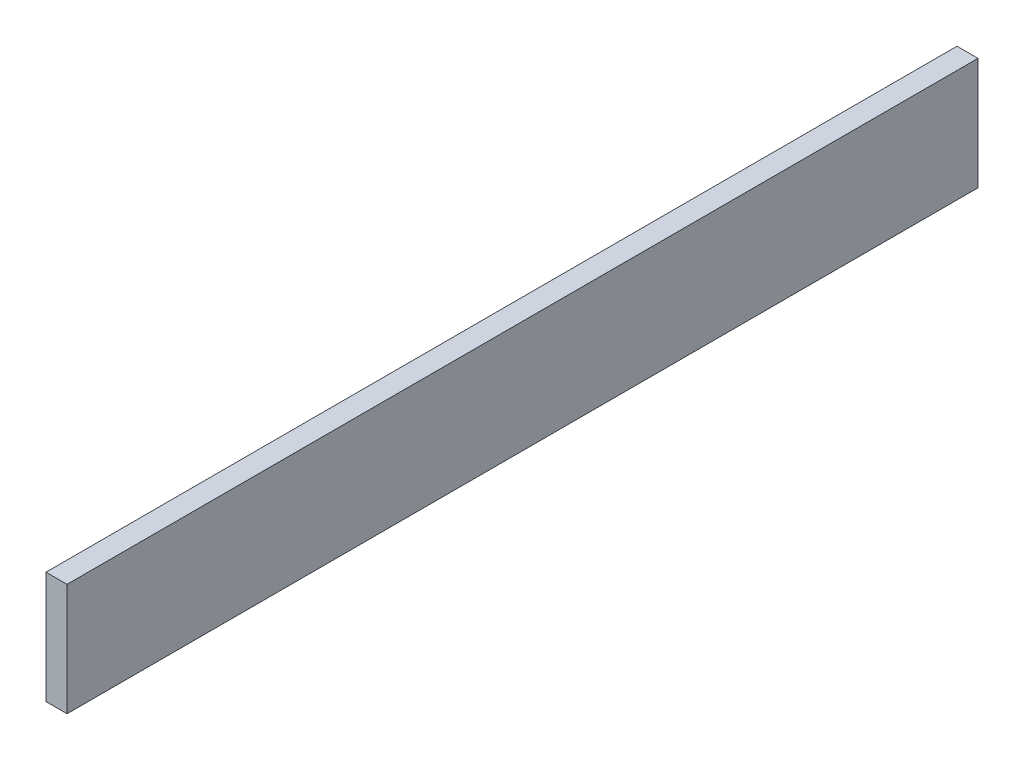
ISO-10303-21;
HEADER;
FILE_DESCRIPTION(('STEP AP214'),'2;1');
FILE_NAME('part.step','',(''),(''),'','','');
FILE_SCHEMA(('AUTOMOTIVE_DESIGN { 1 0 10303 214 1 1 1 1 }'));
ENDSEC;
DATA;
#1=APPLICATION_CONTEXT('core data for automotive mechanical design processes');
#2=APPLICATION_PROTOCOL_DEFINITION('international standard','automotive_design',2000,#1);
#3=PRODUCT_CONTEXT('',#1,'mechanical');
#4=PRODUCT('Part','Part','',(#3));
#5=PRODUCT_RELATED_PRODUCT_CATEGORY('part','',(#4));
#6=PRODUCT_DEFINITION_FORMATION('','',#4);
#7=PRODUCT_DEFINITION_CONTEXT('part definition',#1,'design');
#8=PRODUCT_DEFINITION('design','',#6,#7);
#9=PRODUCT_DEFINITION_SHAPE('','',#8);
#10=(LENGTH_UNIT() NAMED_UNIT(*) SI_UNIT(.MILLI.,.METRE.));
#11=(NAMED_UNIT(*) PLANE_ANGLE_UNIT() SI_UNIT($,.RADIAN.));
#12=(NAMED_UNIT(*) SI_UNIT($,.STERADIAN.) SOLID_ANGLE_UNIT());
#13=UNCERTAINTY_MEASURE_WITH_UNIT(LENGTH_MEASURE(1.E-05),#10,'distance_accuracy_value','');
#14=(GEOMETRIC_REPRESENTATION_CONTEXT(3) GLOBAL_UNCERTAINTY_ASSIGNED_CONTEXT((#13)) GLOBAL_UNIT_ASSIGNED_CONTEXT((#10,
#11,#12)) REPRESENTATION_CONTEXT('',''));
#15=CARTESIAN_POINT('',(0.,0.,0.));
#16=DIRECTION('',(0.,0.,1.));
#17=DIRECTION('',(1.,0.,0.));
#18=AXIS2_PLACEMENT_3D('',#15,#16,#17);
#19=CARTESIAN_POINT('',(3.,12.9513557959912,21.5415250508989));
#20=DIRECTION('',(0.,0.,-1.));
#21=DIRECTION('',(-1.,0.,0.));
#22=AXIS2_PLACEMENT_3D('',#19,#20,#21);
#23=PLANE('',#22);
#24=DIRECTION('',(0.,-1.,0.));
#25=VECTOR('',#24,1.);
#26=CARTESIAN_POINT('',(0.,12.9513557959912,21.5415250508989));
#27=LINE('',#26,#25);
#28=CARTESIAN_POINT('',(0.,12.9513557959912,21.5415250508989));
#29=VERTEX_POINT('',#28);
#30=CARTESIAN_POINT('',(0.,-3.04864420400878,21.5415250508989));
#31=VERTEX_POINT('',#30);
#32=EDGE_CURVE('E96',#29,#31,#27,.T.);
#33=ORIENTED_EDGE('',*,*,#32,.T.);
#34=DIRECTION('',(-1.,0.,0.));
#35=VECTOR('',#34,1.);
#36=CARTESIAN_POINT('',(3.,-3.04864420400878,21.5415250508989));
#37=LINE('',#36,#35);
#38=CARTESIAN_POINT('',(3.,-3.04864420400878,21.5415250508989));
#39=VERTEX_POINT('',#38);
#40=EDGE_CURVE('E11',#39,#31,#37,.T.);
#41=ORIENTED_EDGE('',*,*,#40,.F.);
#42=DIRECTION('',(0.,-1.,0.));
#43=VECTOR('',#42,1.);
#44=CARTESIAN_POINT('',(3.,12.9513557959912,21.5415250508989));
#45=LINE('',#44,#43);
#46=CARTESIAN_POINT('',(3.,12.9513557959912,21.5415250508989));
#47=VERTEX_POINT('',#46);
#48=EDGE_CURVE('E84',#47,#39,#45,.T.);
#49=ORIENTED_EDGE('',*,*,#48,.F.);
#50=DIRECTION('',(-1.,0.,0.));
#51=VECTOR('',#50,1.);
#52=CARTESIAN_POINT('',(3.,12.9513557959912,21.5415250508989));
#53=LINE('',#52,#51);
#54=EDGE_CURVE('E92',#47,#29,#53,.T.);
#55=ORIENTED_EDGE('',*,*,#54,.T.);
#56=EDGE_LOOP('',(#33,#41,#49,#55));
#57=FACE_BOUND('',#56,.T.);
#58=ADVANCED_FACE('F33',(#57),#23,.F.);
#59=CARTESIAN_POINT('',(3.,-3.04864420400878,21.5415250508989));
#60=DIRECTION('',(0.,1.,0.));
#61=DIRECTION('',(0.,0.,1.));
#62=AXIS2_PLACEMENT_3D('',#59,#60,#61);
#63=PLANE('',#62);
#64=DIRECTION('',(0.,0.,-1.));
#65=VECTOR('',#64,1.);
#66=CARTESIAN_POINT('',(0.,-3.04864420400878,21.5415250508989));
#67=LINE('',#66,#65);
#68=CARTESIAN_POINT('',(0.,-3.04864420400878,-108.458474949101));
#69=VERTEX_POINT('',#68);
#70=EDGE_CURVE('E88',#31,#69,#67,.T.);
#71=ORIENTED_EDGE('',*,*,#70,.T.);
#72=DIRECTION('',(-1.,0.,0.));
#73=VECTOR('',#72,1.);
#74=CARTESIAN_POINT('',(3.,-3.04864420400878,-108.458474949101));
#75=LINE('',#74,#73);
#76=CARTESIAN_POINT('',(3.,-3.04864420400878,-108.458474949101));
#77=VERTEX_POINT('',#76);
#78=EDGE_CURVE('E41',#77,#69,#75,.T.);
#79=ORIENTED_EDGE('',*,*,#78,.F.);
#80=DIRECTION('',(0.,0.,-1.));
#81=VECTOR('',#80,1.);
#82=CARTESIAN_POINT('',(3.,-3.04864420400878,21.5415250508989));
#83=LINE('',#82,#81);
#84=EDGE_CURVE('E79',#39,#77,#83,.T.);
#85=ORIENTED_EDGE('',*,*,#84,.F.);
#86=ORIENTED_EDGE('',*,*,#40,.T.);
#87=EDGE_LOOP('',(#71,#79,#85,#86));
#88=FACE_BOUND('',#87,.T.);
#89=ADVANCED_FACE('F87',(#88),#63,.F.);
#90=CARTESIAN_POINT('',(3.,12.9513557959912,-108.458474949101));
#91=DIRECTION('',(0.,0.,1.));
#92=DIRECTION('',(1.,0.,0.));
#93=AXIS2_PLACEMENT_3D('',#90,#91,#92);
#94=PLANE('',#93);
#95=DIRECTION('',(0.,1.,0.));
#96=VECTOR('',#95,1.);
#97=CARTESIAN_POINT('',(0.,12.9513557959912,-108.458474949101));
#98=LINE('',#97,#96);
#99=CARTESIAN_POINT('',(0.,12.9513557959912,-108.458474949101));
#100=VERTEX_POINT('',#99);
#101=EDGE_CURVE('E66',#69,#100,#98,.T.);
#102=ORIENTED_EDGE('',*,*,#101,.T.);
#103=DIRECTION('',(-1.,0.,0.));
#104=VECTOR('',#103,1.);
#105=CARTESIAN_POINT('',(3.,12.9513557959912,-108.458474949101));
#106=LINE('',#105,#104);
#107=CARTESIAN_POINT('',(3.,12.9513557959912,-108.458474949101));
#108=VERTEX_POINT('',#107);
#109=EDGE_CURVE('E89',#108,#100,#106,.T.);
#110=ORIENTED_EDGE('',*,*,#109,.F.);
#111=DIRECTION('',(0.,1.,0.));
#112=VECTOR('',#111,1.);
#113=CARTESIAN_POINT('',(3.,12.9513557959912,-108.458474949101));
#114=LINE('',#113,#112);
#115=EDGE_CURVE('E82',#77,#108,#114,.T.);
#116=ORIENTED_EDGE('',*,*,#115,.F.);
#117=ORIENTED_EDGE('',*,*,#78,.T.);
#118=EDGE_LOOP('',(#102,#110,#116,#117));
#119=FACE_BOUND('',#118,.T.);
#120=ADVANCED_FACE('F90',(#119),#94,.F.);
#121=CARTESIAN_POINT('',(3.,12.9513557959912,21.5415250508989));
#122=DIRECTION('',(0.,-1.,0.));
#123=DIRECTION('',(0.,0.,-1.));
#124=AXIS2_PLACEMENT_3D('',#121,#122,#123);
#125=PLANE('',#124);
#126=DIRECTION('',(0.,0.,1.));
#127=VECTOR('',#126,1.);
#128=CARTESIAN_POINT('',(0.,12.9513557959912,21.5415250508989));
#129=LINE('',#128,#127);
#130=EDGE_CURVE('E72',#100,#29,#129,.T.);
#131=ORIENTED_EDGE('',*,*,#130,.T.);
#132=ORIENTED_EDGE('',*,*,#54,.F.);
#133=DIRECTION('',(0.,0.,1.));
#134=VECTOR('',#133,1.);
#135=CARTESIAN_POINT('',(3.,12.9513557959912,21.5415250508989));
#136=LINE('',#135,#134);
#137=EDGE_CURVE('E49',#108,#47,#136,.T.);
#138=ORIENTED_EDGE('',*,*,#137,.F.);
#139=ORIENTED_EDGE('',*,*,#109,.T.);
#140=EDGE_LOOP('',(#131,#132,#138,#139));
#141=FACE_BOUND('',#140,.T.);
#142=ADVANCED_FACE('F103',(#141),#125,.F.);
#143=CARTESIAN_POINT('',(3.,0.,0.));
#144=DIRECTION('',(1.,0.,0.));
#145=DIRECTION('',(0.,0.,-1.));
#146=AXIS2_PLACEMENT_3D('',#143,#144,#145);
#147=PLANE('',#146);
#148=ORIENTED_EDGE('',*,*,#48,.T.);
#149=ORIENTED_EDGE('',*,*,#84,.T.);
#150=ORIENTED_EDGE('',*,*,#115,.T.);
#151=ORIENTED_EDGE('',*,*,#137,.T.);
#152=EDGE_LOOP('',(#148,#149,#150,#151));
#153=FACE_BOUND('',#152,.T.);
#154=ADVANCED_FACE('F80',(#153),#147,.T.);
#155=CARTESIAN_POINT('',(0.,0.,0.));
#156=DIRECTION('',(1.,0.,0.));
#157=DIRECTION('',(0.,0.,-1.));
#158=AXIS2_PLACEMENT_3D('',#155,#156,#157);
#159=PLANE('',#158);
#160=ORIENTED_EDGE('',*,*,#32,.F.);
#161=ORIENTED_EDGE('',*,*,#130,.F.);
#162=ORIENTED_EDGE('',*,*,#101,.F.);
#163=ORIENTED_EDGE('',*,*,#70,.F.);
#164=EDGE_LOOP('',(#160,#161,#162,#163));
#165=FACE_BOUND('',#164,.T.);
#166=ADVANCED_FACE('F106',(#165),#159,.F.);
#167=CLOSED_SHELL('',(#58,#89,#120,#142,#154,#166));
#168=MANIFOLD_SOLID_BREP('B2',#167);
#169=ADVANCED_BREP_SHAPE_REPRESENTATION('',(#18,#168),#14);
#170=SHAPE_DEFINITION_REPRESENTATION(#9,#169);
ENDSEC;
END-ISO-10303-21;
